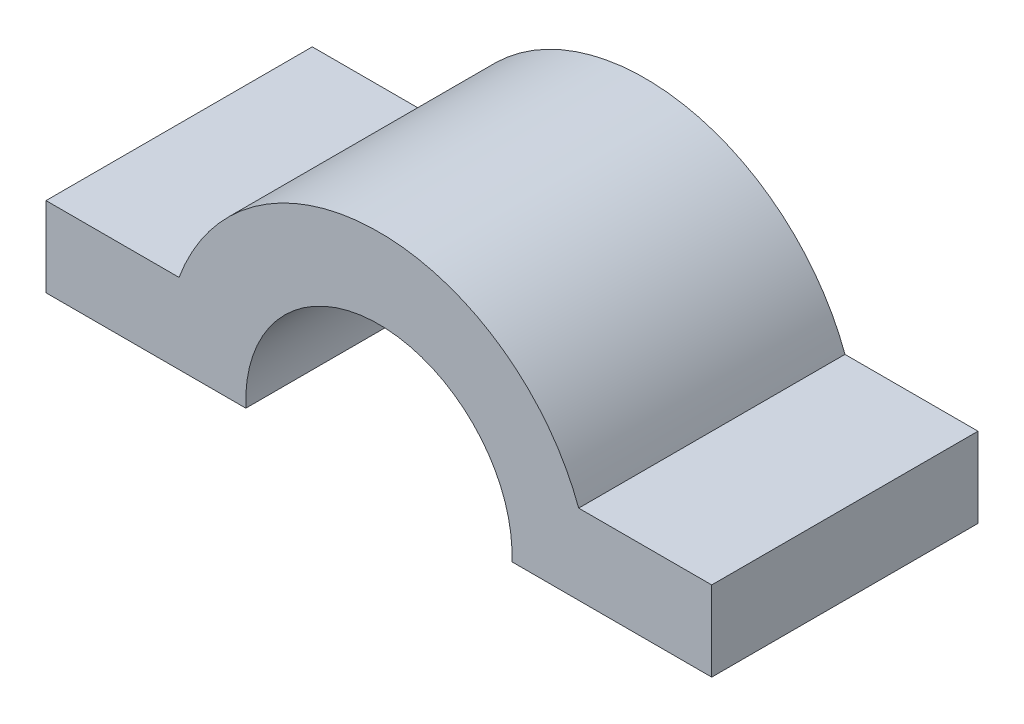
ISO-10303-21;
HEADER;
FILE_DESCRIPTION(('STEP AP214'),'2;1');
FILE_NAME('part.step','',(''),(''),'','','');
FILE_SCHEMA(('AUTOMOTIVE_DESIGN { 1 0 10303 214 1 1 1 1 }'));
ENDSEC;
DATA;
#1=APPLICATION_CONTEXT('core data for automotive mechanical design processes');
#2=APPLICATION_PROTOCOL_DEFINITION('international standard','automotive_design',2000,#1);
#3=PRODUCT_CONTEXT('',#1,'mechanical');
#4=PRODUCT('Part','Part','',(#3));
#5=PRODUCT_RELATED_PRODUCT_CATEGORY('part','',(#4));
#6=PRODUCT_DEFINITION_FORMATION('','',#4);
#7=PRODUCT_DEFINITION_CONTEXT('part definition',#1,'design');
#8=PRODUCT_DEFINITION('design','',#6,#7);
#9=PRODUCT_DEFINITION_SHAPE('','',#8);
#10=(LENGTH_UNIT() NAMED_UNIT(*) SI_UNIT(.MILLI.,.METRE.));
#11=(NAMED_UNIT(*) PLANE_ANGLE_UNIT() SI_UNIT($,.RADIAN.));
#12=(NAMED_UNIT(*) SI_UNIT($,.STERADIAN.) SOLID_ANGLE_UNIT());
#13=UNCERTAINTY_MEASURE_WITH_UNIT(LENGTH_MEASURE(1.E-05),#10,'distance_accuracy_value','');
#14=(GEOMETRIC_REPRESENTATION_CONTEXT(3) GLOBAL_UNCERTAINTY_ASSIGNED_CONTEXT((#13)) GLOBAL_UNIT_ASSIGNED_CONTEXT((#10,
#11,#12)) REPRESENTATION_CONTEXT('',''));
#15=CARTESIAN_POINT('',(0.,0.,0.));
#16=DIRECTION('',(0.,0.,1.));
#17=DIRECTION('',(1.,0.,0.));
#18=AXIS2_PLACEMENT_3D('',#15,#16,#17);
#19=CARTESIAN_POINT('',(-126.867708157946,5.79522447798845,-254.));
#20=DIRECTION('',(0.,0.,1.));
#21=DIRECTION('',(1.,0.,0.));
#22=AXIS2_PLACEMENT_3D('',#19,#20,#21);
#23=CYLINDRICAL_SURFACE('',#22,127.);
#24=CARTESIAN_POINT('',(-126.867708157946,5.79522447798845,0.));
#25=DIRECTION('',(0.,0.,-1.));
#26=DIRECTION('',(1.,0.,0.));
#27=AXIS2_PLACEMENT_3D('',#24,#25,#26);
#28=CIRCLE('',#27,127.);
#29=CARTESIAN_POINT('',(-253.735416315892,0.,0.));
#30=VERTEX_POINT('',#29);
#31=CARTESIAN_POINT('',(0.,0.,0.));
#32=VERTEX_POINT('',#31);
#33=EDGE_CURVE('E128',#30,#32,#28,.T.);
#34=ORIENTED_EDGE('',*,*,#33,.F.);
#35=DIRECTION('',(0.,0.,1.));
#36=VECTOR('',#35,1.);
#37=CARTESIAN_POINT('',(-253.735416315892,0.,-254.));
#38=LINE('',#37,#36);
#39=CARTESIAN_POINT('',(-253.735416315892,0.,-254.));
#40=VERTEX_POINT('',#39);
#41=EDGE_CURVE('E11',#40,#30,#38,.T.);
#42=ORIENTED_EDGE('',*,*,#41,.F.);
#43=CARTESIAN_POINT('',(-126.867708157946,5.79522447798845,-254.));
#44=DIRECTION('',(0.,0.,-1.));
#45=DIRECTION('',(1.,0.,0.));
#46=AXIS2_PLACEMENT_3D('',#43,#44,#45);
#47=CIRCLE('',#46,127.);
#48=CARTESIAN_POINT('',(0.,0.,-254.));
#49=VERTEX_POINT('',#48);
#50=EDGE_CURVE('E148',#40,#49,#47,.T.);
#51=ORIENTED_EDGE('',*,*,#50,.T.);
#52=DIRECTION('',(0.,0.,1.));
#53=VECTOR('',#52,1.);
#54=CARTESIAN_POINT('',(0.,0.,-254.));
#55=LINE('',#54,#53);
#56=EDGE_CURVE('E34',#49,#32,#55,.T.);
#57=ORIENTED_EDGE('',*,*,#56,.T.);
#58=EDGE_LOOP('',(#34,#42,#51,#57));
#59=FACE_BOUND('',#58,.T.);
#60=ADVANCED_FACE('F31',(#59),#23,.F.);
#61=CARTESIAN_POINT('',(-253.735416315892,0.,-254.));
#62=DIRECTION('',(0.,-1.,0.));
#63=DIRECTION('',(1.,0.,0.));
#64=AXIS2_PLACEMENT_3D('',#61,#62,#63);
#65=PLANE('',#64);
#66=DIRECTION('',(1.,0.,0.));
#67=VECTOR('',#66,1.);
#68=CARTESIAN_POINT('',(-253.735416315892,0.,0.));
#69=LINE('',#68,#67);
#70=CARTESIAN_POINT('',(-444.367708157946,0.,0.));
#71=VERTEX_POINT('',#70);
#72=EDGE_CURVE('E146',#71,#30,#69,.T.);
#73=ORIENTED_EDGE('',*,*,#72,.F.);
#74=DIRECTION('',(0.,0.,1.));
#75=VECTOR('',#74,1.);
#76=CARTESIAN_POINT('',(-444.367708157946,0.,-254.));
#77=LINE('',#76,#75);
#78=CARTESIAN_POINT('',(-444.367708157946,0.,-254.));
#79=VERTEX_POINT('',#78);
#80=EDGE_CURVE('E40',#79,#71,#77,.T.);
#81=ORIENTED_EDGE('',*,*,#80,.F.);
#82=DIRECTION('',(1.,0.,0.));
#83=VECTOR('',#82,1.);
#84=CARTESIAN_POINT('',(-253.735416315892,0.,-254.));
#85=LINE('',#84,#83);
#86=EDGE_CURVE('E118',#79,#40,#85,.T.);
#87=ORIENTED_EDGE('',*,*,#86,.T.);
#88=ORIENTED_EDGE('',*,*,#41,.T.);
#89=EDGE_LOOP('',(#73,#81,#87,#88));
#90=FACE_BOUND('',#89,.T.);
#91=ADVANCED_FACE('F160',(#90),#65,.T.);
#92=CARTESIAN_POINT('',(-444.367708157946,0.,-254.));
#93=DIRECTION('',(-1.,0.,0.));
#94=DIRECTION('',(0.,0.,1.));
#95=AXIS2_PLACEMENT_3D('',#92,#93,#94);
#96=PLANE('',#95);
#97=DIRECTION('',(0.,-1.,0.));
#98=VECTOR('',#97,1.);
#99=CARTESIAN_POINT('',(-444.367708157946,0.,0.));
#100=LINE('',#99,#98);
#101=CARTESIAN_POINT('',(-444.367708157946,76.2,0.));
#102=VERTEX_POINT('',#101);
#103=EDGE_CURVE('E105',#102,#71,#100,.T.);
#104=ORIENTED_EDGE('',*,*,#103,.F.);
#105=DIRECTION('',(0.,0.,1.));
#106=VECTOR('',#105,1.);
#107=CARTESIAN_POINT('',(-444.367708157946,76.2,-254.));
#108=LINE('',#107,#106);
#109=CARTESIAN_POINT('',(-444.367708157946,76.2,-254.));
#110=VERTEX_POINT('',#109);
#111=EDGE_CURVE('E100',#110,#102,#108,.T.);
#112=ORIENTED_EDGE('',*,*,#111,.F.);
#113=DIRECTION('',(0.,-1.,0.));
#114=VECTOR('',#113,1.);
#115=CARTESIAN_POINT('',(-444.367708157946,0.,-254.));
#116=LINE('',#115,#114);
#117=EDGE_CURVE('E103',#110,#79,#116,.T.);
#118=ORIENTED_EDGE('',*,*,#117,.T.);
#119=ORIENTED_EDGE('',*,*,#80,.T.);
#120=EDGE_LOOP('',(#104,#112,#118,#119));
#121=FACE_BOUND('',#120,.T.);
#122=ADVANCED_FACE('F102',(#121),#96,.T.);
#123=CARTESIAN_POINT('',(-444.367708157946,76.2,-254.));
#124=DIRECTION('',(0.,1.,0.));
#125=DIRECTION('',(0.,0.,1.));
#126=AXIS2_PLACEMENT_3D('',#123,#124,#125);
#127=PLANE('',#126);
#128=DIRECTION('',(-1.,0.,0.));
#129=VECTOR('',#128,1.);
#130=CARTESIAN_POINT('',(-444.367708157946,76.2,0.));
#131=LINE('',#130,#129);
#132=CARTESIAN_POINT('',(-317.480948998385,76.1999999999999,0.));
#133=VERTEX_POINT('',#132);
#134=EDGE_CURVE('E143',#133,#102,#131,.T.);
#135=ORIENTED_EDGE('',*,*,#134,.F.);
#136=DIRECTION('',(0.,0.,1.));
#137=VECTOR('',#136,1.);
#138=CARTESIAN_POINT('',(-317.480948998385,76.1999999999999,-254.));
#139=LINE('',#138,#137);
#140=CARTESIAN_POINT('',(-317.480948998385,76.1999999999999,-254.));
#141=VERTEX_POINT('',#140);
#142=EDGE_CURVE('E110',#141,#133,#139,.T.);
#143=ORIENTED_EDGE('',*,*,#142,.F.);
#144=DIRECTION('',(-1.,0.,0.));
#145=VECTOR('',#144,1.);
#146=CARTESIAN_POINT('',(-444.367708157946,76.2,-254.));
#147=LINE('',#146,#145);
#148=EDGE_CURVE('E116',#141,#110,#147,.T.);
#149=ORIENTED_EDGE('',*,*,#148,.T.);
#150=ORIENTED_EDGE('',*,*,#111,.T.);
#151=EDGE_LOOP('',(#135,#143,#149,#150));
#152=FACE_BOUND('',#151,.T.);
#153=ADVANCED_FACE('F120',(#152),#127,.T.);
#154=CARTESIAN_POINT('',(-126.867708157946,5.79522447798845,-254.));
#155=DIRECTION('',(0.,0.,1.));
#156=DIRECTION('',(1.,0.,0.));
#157=AXIS2_PLACEMENT_3D('',#154,#155,#156);
#158=CYLINDRICAL_SURFACE('',#157,203.2);
#159=CARTESIAN_POINT('',(-126.867708157946,5.79522447798845,0.));
#160=DIRECTION('',(0.,0.,1.));
#161=DIRECTION('',(1.,0.,0.));
#162=AXIS2_PLACEMENT_3D('',#159,#160,#161);
#163=CIRCLE('',#162,203.2);
#164=CARTESIAN_POINT('',(63.745532682493,76.2,0.));
#165=VERTEX_POINT('',#164);
#166=EDGE_CURVE('E140',#165,#133,#163,.T.);
#167=ORIENTED_EDGE('',*,*,#166,.F.);
#168=DIRECTION('',(0.,0.,1.));
#169=VECTOR('',#168,1.);
#170=CARTESIAN_POINT('',(63.745532682493,76.2,-254.));
#171=LINE('',#170,#169);
#172=CARTESIAN_POINT('',(63.745532682493,76.2,-254.));
#173=VERTEX_POINT('',#172);
#174=EDGE_CURVE('E152',#173,#165,#171,.T.);
#175=ORIENTED_EDGE('',*,*,#174,.F.);
#176=CARTESIAN_POINT('',(-126.867708157946,5.79522447798845,-254.));
#177=DIRECTION('',(0.,0.,1.));
#178=DIRECTION('',(1.,0.,0.));
#179=AXIS2_PLACEMENT_3D('',#176,#177,#178);
#180=CIRCLE('',#179,203.2);
#181=EDGE_CURVE('E121',#173,#141,#180,.T.);
#182=ORIENTED_EDGE('',*,*,#181,.T.);
#183=ORIENTED_EDGE('',*,*,#142,.T.);
#184=EDGE_LOOP('',(#167,#175,#182,#183));
#185=FACE_BOUND('',#184,.T.);
#186=ADVANCED_FACE('F173',(#185),#158,.T.);
#187=CARTESIAN_POINT('',(190.632291842054,76.2,-254.));
#188=DIRECTION('',(0.,1.,0.));
#189=DIRECTION('',(0.,0.,1.));
#190=AXIS2_PLACEMENT_3D('',#187,#188,#189);
#191=PLANE('',#190);
#192=DIRECTION('',(-1.,0.,0.));
#193=VECTOR('',#192,1.);
#194=CARTESIAN_POINT('',(190.632291842054,76.2,0.));
#195=LINE('',#194,#193);
#196=CARTESIAN_POINT('',(190.632291842054,76.2,0.));
#197=VERTEX_POINT('',#196);
#198=EDGE_CURVE('E137',#197,#165,#195,.T.);
#199=ORIENTED_EDGE('',*,*,#198,.F.);
#200=DIRECTION('',(0.,0.,1.));
#201=VECTOR('',#200,1.);
#202=CARTESIAN_POINT('',(190.632291842054,76.2,-254.));
#203=LINE('',#202,#201);
#204=CARTESIAN_POINT('',(190.632291842054,76.2,-254.));
#205=VERTEX_POINT('',#204);
#206=EDGE_CURVE('E154',#205,#197,#203,.T.);
#207=ORIENTED_EDGE('',*,*,#206,.F.);
#208=DIRECTION('',(-1.,0.,0.));
#209=VECTOR('',#208,1.);
#210=CARTESIAN_POINT('',(190.632291842054,76.2,-254.));
#211=LINE('',#210,#209);
#212=EDGE_CURVE('E123',#205,#173,#211,.T.);
#213=ORIENTED_EDGE('',*,*,#212,.T.);
#214=ORIENTED_EDGE('',*,*,#174,.T.);
#215=EDGE_LOOP('',(#199,#207,#213,#214));
#216=FACE_BOUND('',#215,.T.);
#217=ADVANCED_FACE('F176',(#216),#191,.T.);
#218=CARTESIAN_POINT('',(190.632291842054,0.,-254.));
#219=DIRECTION('',(1.,0.,0.));
#220=DIRECTION('',(0.,0.,-1.));
#221=AXIS2_PLACEMENT_3D('',#218,#219,#220);
#222=PLANE('',#221);
#223=DIRECTION('',(0.,1.,0.));
#224=VECTOR('',#223,1.);
#225=CARTESIAN_POINT('',(190.632291842054,0.,0.));
#226=LINE('',#225,#224);
#227=CARTESIAN_POINT('',(190.632291842054,0.,0.));
#228=VERTEX_POINT('',#227);
#229=EDGE_CURVE('E134',#228,#197,#226,.T.);
#230=ORIENTED_EDGE('',*,*,#229,.F.);
#231=DIRECTION('',(0.,0.,1.));
#232=VECTOR('',#231,1.);
#233=CARTESIAN_POINT('',(190.632291842054,0.,-254.));
#234=LINE('',#233,#232);
#235=CARTESIAN_POINT('',(190.632291842054,0.,-254.));
#236=VERTEX_POINT('',#235);
#237=EDGE_CURVE('E155',#236,#228,#234,.T.);
#238=ORIENTED_EDGE('',*,*,#237,.F.);
#239=DIRECTION('',(0.,1.,0.));
#240=VECTOR('',#239,1.);
#241=CARTESIAN_POINT('',(190.632291842054,0.,-254.));
#242=LINE('',#241,#240);
#243=EDGE_CURVE('E251',#236,#205,#242,.T.);
#244=ORIENTED_EDGE('',*,*,#243,.T.);
#245=ORIENTED_EDGE('',*,*,#206,.T.);
#246=EDGE_LOOP('',(#230,#238,#244,#245));
#247=FACE_BOUND('',#246,.T.);
#248=ADVANCED_FACE('F180',(#247),#222,.T.);
#249=CARTESIAN_POINT('',(0.,0.,-254.));
#250=DIRECTION('',(0.,-1.,0.));
#251=DIRECTION('',(0.,0.,-1.));
#252=AXIS2_PLACEMENT_3D('',#249,#250,#251);
#253=PLANE('',#252);
#254=DIRECTION('',(1.,0.,0.));
#255=VECTOR('',#254,1.);
#256=CARTESIAN_POINT('',(0.,0.,0.));
#257=LINE('',#256,#255);
#258=EDGE_CURVE('E131',#32,#228,#257,.T.);
#259=ORIENTED_EDGE('',*,*,#258,.F.);
#260=ORIENTED_EDGE('',*,*,#56,.F.);
#261=DIRECTION('',(1.,0.,0.));
#262=VECTOR('',#261,1.);
#263=CARTESIAN_POINT('',(0.,0.,-254.));
#264=LINE('',#263,#262);
#265=EDGE_CURVE('E252',#49,#236,#264,.T.);
#266=ORIENTED_EDGE('',*,*,#265,.T.);
#267=ORIENTED_EDGE('',*,*,#237,.T.);
#268=EDGE_LOOP('',(#259,#260,#266,#267));
#269=FACE_BOUND('',#268,.T.);
#270=ADVANCED_FACE('F157',(#269),#253,.T.);
#271=CARTESIAN_POINT('',(-126.867708157946,5.79522447798845,-254.));
#272=DIRECTION('',(0.,0.,1.));
#273=DIRECTION('',(1.,0.,0.));
#274=AXIS2_PLACEMENT_3D('',#271,#272,#273);
#275=PLANE('',#274);
#276=ORIENTED_EDGE('',*,*,#50,.F.);
#277=ORIENTED_EDGE('',*,*,#86,.F.);
#278=ORIENTED_EDGE('',*,*,#117,.F.);
#279=ORIENTED_EDGE('',*,*,#148,.F.);
#280=ORIENTED_EDGE('',*,*,#181,.F.);
#281=ORIENTED_EDGE('',*,*,#212,.F.);
#282=ORIENTED_EDGE('',*,*,#243,.F.);
#283=ORIENTED_EDGE('',*,*,#265,.F.);
#284=EDGE_LOOP('',(#276,#277,#278,#279,#280,#281,#282,#283));
#285=FACE_BOUND('',#284,.T.);
#286=ADVANCED_FACE('F114',(#285),#275,.F.);
#287=CARTESIAN_POINT('',(-126.867708157946,5.79522447798845,0.));
#288=DIRECTION('',(0.,0.,1.));
#289=DIRECTION('',(1.,0.,0.));
#290=AXIS2_PLACEMENT_3D('',#287,#288,#289);
#291=PLANE('',#290);
#292=ORIENTED_EDGE('',*,*,#33,.T.);
#293=ORIENTED_EDGE('',*,*,#258,.T.);
#294=ORIENTED_EDGE('',*,*,#229,.T.);
#295=ORIENTED_EDGE('',*,*,#198,.T.);
#296=ORIENTED_EDGE('',*,*,#166,.T.);
#297=ORIENTED_EDGE('',*,*,#134,.T.);
#298=ORIENTED_EDGE('',*,*,#103,.T.);
#299=ORIENTED_EDGE('',*,*,#72,.T.);
#300=EDGE_LOOP('',(#292,#293,#294,#295,#296,#297,#298,#299));
#301=FACE_BOUND('',#300,.T.);
#302=ADVANCED_FACE('F159',(#301),#291,.T.);
#303=CLOSED_SHELL('',(#60,#91,#122,#153,#186,#217,#248,#270,#286,#302));
#304=MANIFOLD_SOLID_BREP('B2',#303);
#305=ADVANCED_BREP_SHAPE_REPRESENTATION('',(#18,#304),#14);
#306=SHAPE_DEFINITION_REPRESENTATION(#9,#305);
ENDSEC;
END-ISO-10303-21;
